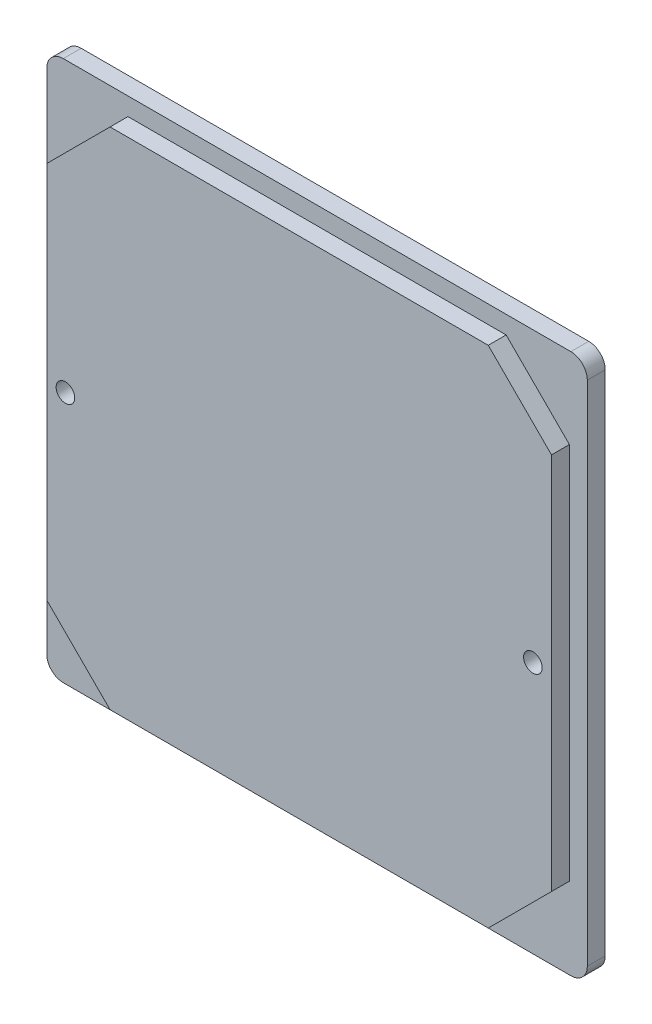
ISO-10303-21;
HEADER;
FILE_DESCRIPTION(('STEP AP214'),'2;1');
FILE_NAME('part.step','',(''),(''),'','','');
FILE_SCHEMA(('AUTOMOTIVE_DESIGN { 1 0 10303 214 1 1 1 1 }'));
ENDSEC;
DATA;
#1=APPLICATION_CONTEXT('core data for automotive mechanical design processes');
#2=APPLICATION_PROTOCOL_DEFINITION('international standard','automotive_design',2000,#1);
#3=PRODUCT_CONTEXT('',#1,'mechanical');
#4=PRODUCT('Part','Part','',(#3));
#5=PRODUCT_RELATED_PRODUCT_CATEGORY('part','',(#4));
#6=PRODUCT_DEFINITION_FORMATION('','',#4);
#7=PRODUCT_DEFINITION_CONTEXT('part definition',#1,'design');
#8=PRODUCT_DEFINITION('design','',#6,#7);
#9=PRODUCT_DEFINITION_SHAPE('','',#8);
#10=(LENGTH_UNIT() NAMED_UNIT(*) SI_UNIT(.MILLI.,.METRE.));
#11=(NAMED_UNIT(*) PLANE_ANGLE_UNIT() SI_UNIT($,.RADIAN.));
#12=(NAMED_UNIT(*) SI_UNIT($,.STERADIAN.) SOLID_ANGLE_UNIT());
#13=UNCERTAINTY_MEASURE_WITH_UNIT(LENGTH_MEASURE(1.E-05),#10,'distance_accuracy_value','');
#14=(GEOMETRIC_REPRESENTATION_CONTEXT(3) GLOBAL_UNCERTAINTY_ASSIGNED_CONTEXT((#13)) GLOBAL_UNIT_ASSIGNED_CONTEXT((#10,
#11,#12)) REPRESENTATION_CONTEXT('',''));
#15=CARTESIAN_POINT('',(0.,0.,0.));
#16=DIRECTION('',(0.,0.,1.));
#17=DIRECTION('',(1.,0.,0.));
#18=AXIS2_PLACEMENT_3D('',#15,#16,#17);
#19=CARTESIAN_POINT('',(0.,0.,5.));
#20=DIRECTION('',(0.,0.,-1.));
#21=DIRECTION('',(-1.,0.,0.));
#22=AXIS2_PLACEMENT_3D('',#19,#20,#21);
#23=PLANE('',#22);
#24=CARTESIAN_POINT('',(32.65,0.,5.));
#25=DIRECTION('',(0.,0.,1.));
#26=DIRECTION('',(1.,0.,0.));
#27=AXIS2_PLACEMENT_3D('',#24,#25,#26);
#28=CIRCLE('',#27,1.3);
#29=CARTESIAN_POINT('',(33.95,0.,5.));
#30=VERTEX_POINT('',#29);
#31=EDGE_CURVE('E238',#30,#30,#28,.T.);
#32=ORIENTED_EDGE('',*,*,#31,.F.);
#33=EDGE_LOOP('',(#32));
#34=FACE_BOUND('',#33,.T.);
#35=CARTESIAN_POINT('',(-32.65,0.,5.));
#36=DIRECTION('',(0.,0.,1.));
#37=DIRECTION('',(1.,0.,0.));
#38=AXIS2_PLACEMENT_3D('',#35,#36,#37);
#39=CIRCLE('',#38,1.3);
#40=CARTESIAN_POINT('',(-31.35,0.,5.));
#41=VERTEX_POINT('',#40);
#42=EDGE_CURVE('E244',#41,#41,#39,.T.);
#43=ORIENTED_EDGE('',*,*,#42,.F.);
#44=EDGE_LOOP('',(#43));
#45=FACE_BOUND('',#44,.T.);
#46=DIRECTION('',(-0.707106781186551,-0.707106781186544,0.));
#47=VECTOR('',#46,1.);
#48=CARTESIAN_POINT('',(-26.4111652351681,35.25,5.));
#49=LINE('',#48,#47);
#50=CARTESIAN_POINT('',(-26.4111652351681,35.25,5.));
#51=VERTEX_POINT('',#50);
#52=CARTESIAN_POINT('',(-35.25,26.4111652351682,5.));
#53=VERTEX_POINT('',#52);
#54=EDGE_CURVE('E195',#51,#53,#49,.T.);
#55=ORIENTED_EDGE('',*,*,#54,.T.);
#56=DIRECTION('',(0.,-1.,0.));
#57=VECTOR('',#56,1.);
#58=CARTESIAN_POINT('',(-35.25,26.4111652351682,5.));
#59=LINE('',#58,#57);
#60=CARTESIAN_POINT('',(-35.25,-26.4111652351682,5.));
#61=VERTEX_POINT('',#60);
#62=EDGE_CURVE('E155',#53,#61,#59,.T.);
#63=ORIENTED_EDGE('',*,*,#62,.T.);
#64=DIRECTION('',(0.70710678118655,-0.707106781186544,0.));
#65=VECTOR('',#64,1.);
#66=CARTESIAN_POINT('',(-26.4111652351681,-35.25,5.));
#67=LINE('',#66,#65);
#68=CARTESIAN_POINT('',(-26.4111652351681,-35.25,5.));
#69=VERTEX_POINT('',#68);
#70=EDGE_CURVE('E52',#61,#69,#67,.T.);
#71=ORIENTED_EDGE('',*,*,#70,.T.);
#72=DIRECTION('',(1.,0.,0.));
#73=VECTOR('',#72,1.);
#74=CARTESIAN_POINT('',(-26.4111652351681,-35.25,5.));
#75=LINE('',#74,#73);
#76=CARTESIAN_POINT('',(26.4111652351681,-35.25,5.));
#77=VERTEX_POINT('',#76);
#78=EDGE_CURVE('E199',#69,#77,#75,.T.);
#79=ORIENTED_EDGE('',*,*,#78,.T.);
#80=DIRECTION('',(0.70710678118655,0.707106781186544,0.));
#81=VECTOR('',#80,1.);
#82=CARTESIAN_POINT('',(26.4111652351681,-35.25,5.));
#83=LINE('',#82,#81);
#84=CARTESIAN_POINT('',(35.25,-26.4111652351682,5.));
#85=VERTEX_POINT('',#84);
#86=EDGE_CURVE('E202',#77,#85,#83,.T.);
#87=ORIENTED_EDGE('',*,*,#86,.T.);
#88=DIRECTION('',(0.,1.,0.));
#89=VECTOR('',#88,1.);
#90=CARTESIAN_POINT('',(35.25,26.4111652351682,5.));
#91=LINE('',#90,#89);
#92=CARTESIAN_POINT('',(35.25,26.4111652351682,5.));
#93=VERTEX_POINT('',#92);
#94=EDGE_CURVE('E205',#85,#93,#91,.T.);
#95=ORIENTED_EDGE('',*,*,#94,.T.);
#96=DIRECTION('',(-0.707106781186551,0.707106781186544,0.));
#97=VECTOR('',#96,1.);
#98=CARTESIAN_POINT('',(26.4111652351681,35.25,5.));
#99=LINE('',#98,#97);
#100=CARTESIAN_POINT('',(26.4111652351681,35.25,5.));
#101=VERTEX_POINT('',#100);
#102=EDGE_CURVE('E178',#93,#101,#99,.T.);
#103=ORIENTED_EDGE('',*,*,#102,.T.);
#104=DIRECTION('',(-1.,0.,0.));
#105=VECTOR('',#104,1.);
#106=CARTESIAN_POINT('',(-26.4111652351681,35.25,5.));
#107=LINE('',#106,#105);
#108=EDGE_CURVE('E175',#101,#51,#107,.T.);
#109=ORIENTED_EDGE('',*,*,#108,.T.);
#110=EDGE_LOOP('',(#55,#63,#71,#79,#87,#95,#103,#109));
#111=FACE_BOUND('',#110,.T.);
#112=ADVANCED_FACE('F37',(#34,#45,#111),#23,.F.);
#113=CARTESIAN_POINT('',(37.75,-37.75,5.));
#114=DIRECTION('',(-1.,0.,0.));
#115=DIRECTION('',(0.,0.,1.));
#116=AXIS2_PLACEMENT_3D('',#113,#114,#115);
#117=PLANE('',#116);
#118=DIRECTION('',(0.,1.,0.));
#119=VECTOR('',#118,1.);
#120=CARTESIAN_POINT('',(37.75,-35.45,2.5));
#121=LINE('',#120,#119);
#122=CARTESIAN_POINT('',(37.75,-35.45,2.5));
#123=VERTEX_POINT('',#122);
#124=CARTESIAN_POINT('',(37.75,35.45,2.5));
#125=VERTEX_POINT('',#124);
#126=EDGE_CURVE('E228',#123,#125,#121,.T.);
#127=ORIENTED_EDGE('',*,*,#126,.F.);
#128=DIRECTION('',(0.,0.,-1.));
#129=VECTOR('',#128,1.);
#130=CARTESIAN_POINT('',(37.75,-35.45,5.));
#131=LINE('',#130,#129);
#132=CARTESIAN_POINT('',(37.75,-35.45,0.));
#133=VERTEX_POINT('',#132);
#134=EDGE_CURVE('E264',#123,#133,#131,.T.);
#135=ORIENTED_EDGE('',*,*,#134,.T.);
#136=DIRECTION('',(0.,1.,0.));
#137=VECTOR('',#136,1.);
#138=CARTESIAN_POINT('',(37.75,-37.75,0.));
#139=LINE('',#138,#137);
#140=CARTESIAN_POINT('',(37.75,35.45,0.));
#141=VERTEX_POINT('',#140);
#142=EDGE_CURVE('E247',#133,#141,#139,.T.);
#143=ORIENTED_EDGE('',*,*,#142,.T.);
#144=DIRECTION('',(0.,0.,-1.));
#145=VECTOR('',#144,1.);
#146=CARTESIAN_POINT('',(37.75,35.45,5.));
#147=LINE('',#146,#145);
#148=EDGE_CURVE('E261',#141,#125,#147,.F.);
#149=ORIENTED_EDGE('',*,*,#148,.T.);
#150=EDGE_LOOP('',(#127,#135,#143,#149));
#151=FACE_BOUND('',#150,.T.);
#152=ADVANCED_FACE('F316',(#151),#117,.F.);
#153=CARTESIAN_POINT('',(-37.75,37.75,5.));
#154=DIRECTION('',(0.,-1.,0.));
#155=DIRECTION('',(0.,0.,-1.));
#156=AXIS2_PLACEMENT_3D('',#153,#154,#155);
#157=PLANE('',#156);
#158=DIRECTION('',(-1.,0.,0.));
#159=VECTOR('',#158,1.);
#160=CARTESIAN_POINT('',(35.45,37.75,2.5));
#161=LINE('',#160,#159);
#162=CARTESIAN_POINT('',(35.45,37.75,2.5));
#163=VERTEX_POINT('',#162);
#164=CARTESIAN_POINT('',(-35.45,37.75,2.5));
#165=VERTEX_POINT('',#164);
#166=EDGE_CURVE('E60',#163,#165,#161,.T.);
#167=ORIENTED_EDGE('',*,*,#166,.F.);
#168=DIRECTION('',(0.,0.,-1.));
#169=VECTOR('',#168,1.);
#170=CARTESIAN_POINT('',(35.45,37.75,5.));
#171=LINE('',#170,#169);
#172=CARTESIAN_POINT('',(35.45,37.75,0.));
#173=VERTEX_POINT('',#172);
#174=EDGE_CURVE('E11',#163,#173,#171,.T.);
#175=ORIENTED_EDGE('',*,*,#174,.T.);
#176=DIRECTION('',(-1.,0.,0.));
#177=VECTOR('',#176,1.);
#178=CARTESIAN_POINT('',(-37.75,37.75,0.));
#179=LINE('',#178,#177);
#180=CARTESIAN_POINT('',(-35.45,37.75,0.));
#181=VERTEX_POINT('',#180);
#182=EDGE_CURVE('E252',#173,#181,#179,.T.);
#183=ORIENTED_EDGE('',*,*,#182,.T.);
#184=DIRECTION('',(0.,0.,-1.));
#185=VECTOR('',#184,1.);
#186=CARTESIAN_POINT('',(-35.45,37.75,5.));
#187=LINE('',#186,#185);
#188=EDGE_CURVE('E45',#181,#165,#187,.F.);
#189=ORIENTED_EDGE('',*,*,#188,.T.);
#190=EDGE_LOOP('',(#167,#175,#183,#189));
#191=FACE_BOUND('',#190,.T.);
#192=ADVANCED_FACE('F286',(#191),#157,.F.);
#193=CARTESIAN_POINT('',(-37.75,-37.75,5.));
#194=DIRECTION('',(1.,0.,0.));
#195=DIRECTION('',(0.,0.,-1.));
#196=AXIS2_PLACEMENT_3D('',#193,#194,#195);
#197=PLANE('',#196);
#198=DIRECTION('',(0.,-1.,0.));
#199=VECTOR('',#198,1.);
#200=CARTESIAN_POINT('',(-37.75,35.45,2.5));
#201=LINE('',#200,#199);
#202=CARTESIAN_POINT('',(-37.75,35.45,2.5));
#203=VERTEX_POINT('',#202);
#204=CARTESIAN_POINT('',(-37.75,-35.45,2.5));
#205=VERTEX_POINT('',#204);
#206=EDGE_CURVE('E235',#203,#205,#201,.T.);
#207=ORIENTED_EDGE('',*,*,#206,.F.);
#208=DIRECTION('',(0.,0.,-1.));
#209=VECTOR('',#208,1.);
#210=CARTESIAN_POINT('',(-37.75,35.45,5.));
#211=LINE('',#210,#209);
#212=CARTESIAN_POINT('',(-37.75,35.45,0.));
#213=VERTEX_POINT('',#212);
#214=EDGE_CURVE('E279',#203,#213,#211,.T.);
#215=ORIENTED_EDGE('',*,*,#214,.T.);
#216=DIRECTION('',(0.,-1.,0.));
#217=VECTOR('',#216,1.);
#218=CARTESIAN_POINT('',(-37.75,-37.75,0.));
#219=LINE('',#218,#217);
#220=CARTESIAN_POINT('',(-37.75,-35.45,0.));
#221=VERTEX_POINT('',#220);
#222=EDGE_CURVE('E255',#213,#221,#219,.T.);
#223=ORIENTED_EDGE('',*,*,#222,.T.);
#224=DIRECTION('',(0.,0.,-1.));
#225=VECTOR('',#224,1.);
#226=CARTESIAN_POINT('',(-37.75,-35.45,5.));
#227=LINE('',#226,#225);
#228=EDGE_CURVE('E281',#221,#205,#227,.F.);
#229=ORIENTED_EDGE('',*,*,#228,.T.);
#230=EDGE_LOOP('',(#207,#215,#223,#229));
#231=FACE_BOUND('',#230,.T.);
#232=ADVANCED_FACE('F296',(#231),#197,.F.);
#233=CARTESIAN_POINT('',(-37.75,-37.75,5.));
#234=DIRECTION('',(0.,1.,0.));
#235=DIRECTION('',(0.,0.,1.));
#236=AXIS2_PLACEMENT_3D('',#233,#234,#235);
#237=PLANE('',#236);
#238=DIRECTION('',(1.,0.,0.));
#239=VECTOR('',#238,1.);
#240=CARTESIAN_POINT('',(-35.45,-37.75,2.5));
#241=LINE('',#240,#239);
#242=CARTESIAN_POINT('',(-35.45,-37.75,2.5));
#243=VERTEX_POINT('',#242);
#244=CARTESIAN_POINT('',(35.45,-37.75,2.5));
#245=VERTEX_POINT('',#244);
#246=EDGE_CURVE('E224',#243,#245,#241,.T.);
#247=ORIENTED_EDGE('',*,*,#246,.F.);
#248=DIRECTION('',(0.,0.,-1.));
#249=VECTOR('',#248,1.);
#250=CARTESIAN_POINT('',(-35.45,-37.75,5.));
#251=LINE('',#250,#249);
#252=CARTESIAN_POINT('',(-35.45,-37.75,0.));
#253=VERTEX_POINT('',#252);
#254=EDGE_CURVE('E274',#243,#253,#251,.T.);
#255=ORIENTED_EDGE('',*,*,#254,.T.);
#256=DIRECTION('',(1.,0.,0.));
#257=VECTOR('',#256,1.);
#258=CARTESIAN_POINT('',(-37.75,-37.75,0.));
#259=LINE('',#258,#257);
#260=CARTESIAN_POINT('',(35.45,-37.75,0.));
#261=VERTEX_POINT('',#260);
#262=EDGE_CURVE('E258',#253,#261,#259,.T.);
#263=ORIENTED_EDGE('',*,*,#262,.T.);
#264=DIRECTION('',(0.,0.,-1.));
#265=VECTOR('',#264,1.);
#266=CARTESIAN_POINT('',(35.45,-37.75,5.));
#267=LINE('',#266,#265);
#268=EDGE_CURVE('E276',#261,#245,#267,.F.);
#269=ORIENTED_EDGE('',*,*,#268,.T.);
#270=EDGE_LOOP('',(#247,#255,#263,#269));
#271=FACE_BOUND('',#270,.T.);
#272=ADVANCED_FACE('F306',(#271),#237,.F.);
#273=CARTESIAN_POINT('',(35.45,-35.45,5.));
#274=DIRECTION('',(0.,0.,-1.));
#275=DIRECTION('',(-1.,0.,0.));
#276=AXIS2_PLACEMENT_3D('',#273,#274,#275);
#277=CYLINDRICAL_SURFACE('',#276,2.3);
#278=ORIENTED_EDGE('',*,*,#134,.F.);
#279=CARTESIAN_POINT('',(35.45,-35.45,2.5));
#280=DIRECTION('',(0.,0.,1.));
#281=DIRECTION('',(1.,0.,0.));
#282=AXIS2_PLACEMENT_3D('',#279,#280,#281);
#283=CIRCLE('',#282,2.3);
#284=EDGE_CURVE('E226',#245,#123,#283,.T.);
#285=ORIENTED_EDGE('',*,*,#284,.F.);
#286=ORIENTED_EDGE('',*,*,#268,.F.);
#287=CARTESIAN_POINT('',(35.45,-35.45,0.));
#288=DIRECTION('',(0.,0.,-1.));
#289=DIRECTION('',(-1.,0.,0.));
#290=AXIS2_PLACEMENT_3D('',#287,#288,#289);
#291=CIRCLE('',#290,2.3);
#292=EDGE_CURVE('E272',#133,#261,#291,.T.);
#293=ORIENTED_EDGE('',*,*,#292,.F.);
#294=EDGE_LOOP('',(#278,#285,#286,#293));
#295=FACE_BOUND('',#294,.T.);
#296=ADVANCED_FACE('F311',(#295),#277,.T.);
#297=CARTESIAN_POINT('',(-35.45,-35.45,5.));
#298=DIRECTION('',(0.,0.,-1.));
#299=DIRECTION('',(-1.,0.,0.));
#300=AXIS2_PLACEMENT_3D('',#297,#298,#299);
#301=CYLINDRICAL_SURFACE('',#300,2.3);
#302=ORIENTED_EDGE('',*,*,#254,.F.);
#303=CARTESIAN_POINT('',(-35.45,-35.45,2.5));
#304=DIRECTION('',(0.,0.,1.));
#305=DIRECTION('',(1.,0.,0.));
#306=AXIS2_PLACEMENT_3D('',#303,#304,#305);
#307=CIRCLE('',#306,2.3);
#308=EDGE_CURVE('E211',#205,#243,#307,.T.);
#309=ORIENTED_EDGE('',*,*,#308,.F.);
#310=ORIENTED_EDGE('',*,*,#228,.F.);
#311=CARTESIAN_POINT('',(-35.45,-35.45,0.));
#312=DIRECTION('',(0.,0.,-1.));
#313=DIRECTION('',(-1.,0.,0.));
#314=AXIS2_PLACEMENT_3D('',#311,#312,#313);
#315=CIRCLE('',#314,2.3);
#316=EDGE_CURVE('E270',#253,#221,#315,.T.);
#317=ORIENTED_EDGE('',*,*,#316,.F.);
#318=EDGE_LOOP('',(#302,#309,#310,#317));
#319=FACE_BOUND('',#318,.T.);
#320=ADVANCED_FACE('F301',(#319),#301,.T.);
#321=CARTESIAN_POINT('',(35.45,35.45,5.));
#322=DIRECTION('',(0.,0.,-1.));
#323=DIRECTION('',(-1.,0.,0.));
#324=AXIS2_PLACEMENT_3D('',#321,#322,#323);
#325=CYLINDRICAL_SURFACE('',#324,2.3);
#326=ORIENTED_EDGE('',*,*,#174,.F.);
#327=CARTESIAN_POINT('',(35.45,35.45,2.5));
#328=DIRECTION('',(0.,0.,1.));
#329=DIRECTION('',(1.,0.,0.));
#330=AXIS2_PLACEMENT_3D('',#327,#328,#329);
#331=CIRCLE('',#330,2.30000000000001);
#332=EDGE_CURVE('E230',#125,#163,#331,.T.);
#333=ORIENTED_EDGE('',*,*,#332,.F.);
#334=ORIENTED_EDGE('',*,*,#148,.F.);
#335=CARTESIAN_POINT('',(35.45,35.45,0.));
#336=DIRECTION('',(0.,0.,-1.));
#337=DIRECTION('',(-1.,0.,0.));
#338=AXIS2_PLACEMENT_3D('',#335,#336,#337);
#339=CIRCLE('',#338,2.3);
#340=EDGE_CURVE('E268',#173,#141,#339,.T.);
#341=ORIENTED_EDGE('',*,*,#340,.F.);
#342=EDGE_LOOP('',(#326,#333,#334,#341));
#343=FACE_BOUND('',#342,.T.);
#344=ADVANCED_FACE('F320',(#343),#325,.T.);
#345=CARTESIAN_POINT('',(-35.45,35.45,5.));
#346=DIRECTION('',(0.,0.,-1.));
#347=DIRECTION('',(-1.,0.,0.));
#348=AXIS2_PLACEMENT_3D('',#345,#346,#347);
#349=CYLINDRICAL_SURFACE('',#348,2.3);
#350=ORIENTED_EDGE('',*,*,#214,.F.);
#351=CARTESIAN_POINT('',(-35.45,35.45,2.5));
#352=DIRECTION('',(0.,0.,1.));
#353=DIRECTION('',(1.,0.,0.));
#354=AXIS2_PLACEMENT_3D('',#351,#352,#353);
#355=CIRCLE('',#354,2.3);
#356=EDGE_CURVE('E233',#165,#203,#355,.T.);
#357=ORIENTED_EDGE('',*,*,#356,.F.);
#358=ORIENTED_EDGE('',*,*,#188,.F.);
#359=CARTESIAN_POINT('',(-35.45,35.45,0.));
#360=DIRECTION('',(0.,0.,-1.));
#361=DIRECTION('',(-1.,0.,0.));
#362=AXIS2_PLACEMENT_3D('',#359,#360,#361);
#363=CIRCLE('',#362,2.3);
#364=EDGE_CURVE('E266',#213,#181,#363,.T.);
#365=ORIENTED_EDGE('',*,*,#364,.F.);
#366=EDGE_LOOP('',(#350,#357,#358,#365));
#367=FACE_BOUND('',#366,.T.);
#368=ADVANCED_FACE('F39',(#367),#349,.T.);
#369=CARTESIAN_POINT('',(0.,0.,0.));
#370=DIRECTION('',(0.,0.,-1.));
#371=DIRECTION('',(-1.,0.,0.));
#372=AXIS2_PLACEMENT_3D('',#369,#370,#371);
#373=PLANE('',#372);
#374=CARTESIAN_POINT('',(-32.65,0.,0.));
#375=DIRECTION('',(0.,0.,1.));
#376=DIRECTION('',(1.,0.,0.));
#377=AXIS2_PLACEMENT_3D('',#374,#375,#376);
#378=CIRCLE('',#377,1.3);
#379=CARTESIAN_POINT('',(-31.35,0.,0.));
#380=VERTEX_POINT('',#379);
#381=EDGE_CURVE('E241',#380,#380,#378,.T.);
#382=ORIENTED_EDGE('',*,*,#381,.T.);
#383=EDGE_LOOP('',(#382));
#384=FACE_BOUND('',#383,.T.);
#385=ORIENTED_EDGE('',*,*,#142,.F.);
#386=ORIENTED_EDGE('',*,*,#292,.T.);
#387=ORIENTED_EDGE('',*,*,#262,.F.);
#388=ORIENTED_EDGE('',*,*,#316,.T.);
#389=ORIENTED_EDGE('',*,*,#222,.F.);
#390=ORIENTED_EDGE('',*,*,#364,.T.);
#391=ORIENTED_EDGE('',*,*,#182,.F.);
#392=ORIENTED_EDGE('',*,*,#340,.T.);
#393=EDGE_LOOP('',(#385,#386,#387,#388,#389,#390,#391,#392));
#394=FACE_BOUND('',#393,.T.);
#395=CARTESIAN_POINT('',(32.65,0.,0.));
#396=DIRECTION('',(0.,0.,1.));
#397=DIRECTION('',(1.,0.,0.));
#398=AXIS2_PLACEMENT_3D('',#395,#396,#397);
#399=CIRCLE('',#398,1.3);
#400=CARTESIAN_POINT('',(33.95,0.,0.));
#401=VERTEX_POINT('',#400);
#402=EDGE_CURVE('E237',#401,#401,#399,.T.);
#403=ORIENTED_EDGE('',*,*,#402,.T.);
#404=EDGE_LOOP('',(#403));
#405=FACE_BOUND('',#404,.T.);
#406=ADVANCED_FACE('F322',(#384,#394,#405),#373,.T.);
#407=CARTESIAN_POINT('',(-32.65,0.,5.));
#408=DIRECTION('',(0.,0.,-1.));
#409=DIRECTION('',(-1.,0.,0.));
#410=AXIS2_PLACEMENT_3D('',#407,#408,#409);
#411=CYLINDRICAL_SURFACE('',#410,1.3);
#412=ORIENTED_EDGE('',*,*,#42,.T.);
#413=EDGE_LOOP('',(#412));
#414=FACE_BOUND('',#413,.T.);
#415=ORIENTED_EDGE('',*,*,#381,.F.);
#416=EDGE_LOOP('',(#415));
#417=FACE_BOUND('',#416,.T.);
#418=ADVANCED_FACE('F325',(#414,#417),#411,.F.);
#419=CARTESIAN_POINT('',(32.65,0.,5.));
#420=DIRECTION('',(0.,0.,-1.));
#421=DIRECTION('',(-1.,0.,0.));
#422=AXIS2_PLACEMENT_3D('',#419,#420,#421);
#423=CYLINDRICAL_SURFACE('',#422,1.3);
#424=ORIENTED_EDGE('',*,*,#31,.T.);
#425=EDGE_LOOP('',(#424));
#426=FACE_BOUND('',#425,.T.);
#427=ORIENTED_EDGE('',*,*,#402,.F.);
#428=EDGE_LOOP('',(#427));
#429=FACE_BOUND('',#428,.T.);
#430=ADVANCED_FACE('F330',(#426,#429),#423,.F.);
#431=CARTESIAN_POINT('',(-35.45,-35.45,2.5));
#432=DIRECTION('',(0.,0.,1.));
#433=DIRECTION('',(1.,0.,0.));
#434=AXIS2_PLACEMENT_3D('',#431,#432,#433);
#435=PLANE('',#434);
#436=DIRECTION('',(-1.,0.,0.));
#437=VECTOR('',#436,1.);
#438=CARTESIAN_POINT('',(-26.4111652351681,35.25,2.5));
#439=LINE('',#438,#437);
#440=CARTESIAN_POINT('',(26.4111652351681,35.25,2.5));
#441=VERTEX_POINT('',#440);
#442=CARTESIAN_POINT('',(-26.4111652351681,35.25,2.5));
#443=VERTEX_POINT('',#442);
#444=EDGE_CURVE('E161',#441,#443,#439,.T.);
#445=ORIENTED_EDGE('',*,*,#444,.F.);
#446=DIRECTION('',(-0.707106781186551,0.707106781186544,0.));
#447=VECTOR('',#446,1.);
#448=CARTESIAN_POINT('',(26.4111652351681,35.25,2.5));
#449=LINE('',#448,#447);
#450=CARTESIAN_POINT('',(35.25,26.4111652351682,2.5));
#451=VERTEX_POINT('',#450);
#452=EDGE_CURVE('E191',#451,#441,#449,.T.);
#453=ORIENTED_EDGE('',*,*,#452,.F.);
#454=DIRECTION('',(0.,1.,0.));
#455=VECTOR('',#454,1.);
#456=CARTESIAN_POINT('',(35.25,26.4111652351682,2.5));
#457=LINE('',#456,#455);
#458=CARTESIAN_POINT('',(35.25,-26.4111652351682,2.5));
#459=VERTEX_POINT('',#458);
#460=EDGE_CURVE('E188',#459,#451,#457,.T.);
#461=ORIENTED_EDGE('',*,*,#460,.F.);
#462=DIRECTION('',(0.70710678118655,0.707106781186544,0.));
#463=VECTOR('',#462,1.);
#464=CARTESIAN_POINT('',(26.4111652351681,-35.25,2.5));
#465=LINE('',#464,#463);
#466=CARTESIAN_POINT('',(26.4111652351681,-35.25,2.5));
#467=VERTEX_POINT('',#466);
#468=EDGE_CURVE('E185',#467,#459,#465,.T.);
#469=ORIENTED_EDGE('',*,*,#468,.F.);
#470=DIRECTION('',(1.,0.,0.));
#471=VECTOR('',#470,1.);
#472=CARTESIAN_POINT('',(-26.4111652351681,-35.25,2.5));
#473=LINE('',#472,#471);
#474=CARTESIAN_POINT('',(-26.4111652351681,-35.25,2.5));
#475=VERTEX_POINT('',#474);
#476=EDGE_CURVE('E182',#475,#467,#473,.T.);
#477=ORIENTED_EDGE('',*,*,#476,.F.);
#478=DIRECTION('',(0.70710678118655,-0.707106781186544,0.));
#479=VECTOR('',#478,1.);
#480=CARTESIAN_POINT('',(-26.4111652351681,-35.25,2.5));
#481=LINE('',#480,#479);
#482=CARTESIAN_POINT('',(-35.25,-26.4111652351682,2.5));
#483=VERTEX_POINT('',#482);
#484=EDGE_CURVE('E171',#483,#475,#481,.T.);
#485=ORIENTED_EDGE('',*,*,#484,.F.);
#486=DIRECTION('',(0.,-1.,0.));
#487=VECTOR('',#486,1.);
#488=CARTESIAN_POINT('',(-35.25,26.4111652351682,2.5));
#489=LINE('',#488,#487);
#490=CARTESIAN_POINT('',(-35.25,26.4111652351682,2.5));
#491=VERTEX_POINT('',#490);
#492=EDGE_CURVE('E153',#491,#483,#489,.T.);
#493=ORIENTED_EDGE('',*,*,#492,.F.);
#494=DIRECTION('',(-0.707106781186551,-0.707106781186544,0.));
#495=VECTOR('',#494,1.);
#496=CARTESIAN_POINT('',(-26.4111652351681,35.25,2.5));
#497=LINE('',#496,#495);
#498=EDGE_CURVE('E167',#443,#491,#497,.T.);
#499=ORIENTED_EDGE('',*,*,#498,.F.);
#500=EDGE_LOOP('',(#445,#453,#461,#469,#477,#485,#493,#499));
#501=FACE_BOUND('',#500,.T.);
#502=ORIENTED_EDGE('',*,*,#308,.T.);
#503=ORIENTED_EDGE('',*,*,#246,.T.);
#504=ORIENTED_EDGE('',*,*,#284,.T.);
#505=ORIENTED_EDGE('',*,*,#126,.T.);
#506=ORIENTED_EDGE('',*,*,#332,.T.);
#507=ORIENTED_EDGE('',*,*,#166,.T.);
#508=ORIENTED_EDGE('',*,*,#356,.T.);
#509=ORIENTED_EDGE('',*,*,#206,.T.);
#510=EDGE_LOOP('',(#502,#503,#504,#505,#506,#507,#508,#509));
#511=FACE_BOUND('',#510,.T.);
#512=ADVANCED_FACE('F166',(#501,#511),#435,.T.);
#513=CARTESIAN_POINT('',(-26.4111652351681,35.25,2.5));
#514=DIRECTION('',(-0.707106781186544,0.707106781186551,0.));
#515=DIRECTION('',(-0.707106781186551,-0.707106781186544,0.));
#516=AXIS2_PLACEMENT_3D('',#513,#514,#515);
#517=PLANE('',#516);
#518=ORIENTED_EDGE('',*,*,#54,.F.);
#519=DIRECTION('',(0.,0.,1.));
#520=VECTOR('',#519,1.);
#521=CARTESIAN_POINT('',(-26.4111652351681,35.25,2.5));
#522=LINE('',#521,#520);
#523=EDGE_CURVE('E174',#443,#51,#522,.T.);
#524=ORIENTED_EDGE('',*,*,#523,.F.);
#525=ORIENTED_EDGE('',*,*,#498,.T.);
#526=DIRECTION('',(0.,0.,1.));
#527=VECTOR('',#526,1.);
#528=CARTESIAN_POINT('',(-35.25,26.4111652351682,2.5));
#529=LINE('',#528,#527);
#530=EDGE_CURVE('E150',#491,#53,#529,.T.);
#531=ORIENTED_EDGE('',*,*,#530,.T.);
#532=EDGE_LOOP('',(#518,#524,#525,#531));
#533=FACE_BOUND('',#532,.T.);
#534=ADVANCED_FACE('F173',(#533),#517,.T.);
#535=CARTESIAN_POINT('',(-26.4111652351681,35.25,2.5));
#536=DIRECTION('',(0.,1.,0.));
#537=DIRECTION('',(-1.,0.,0.));
#538=AXIS2_PLACEMENT_3D('',#535,#536,#537);
#539=PLANE('',#538);
#540=ORIENTED_EDGE('',*,*,#108,.F.);
#541=DIRECTION('',(0.,0.,1.));
#542=VECTOR('',#541,1.);
#543=CARTESIAN_POINT('',(26.4111652351681,35.25,2.5));
#544=LINE('',#543,#542);
#545=EDGE_CURVE('E212',#441,#101,#544,.T.);
#546=ORIENTED_EDGE('',*,*,#545,.F.);
#547=ORIENTED_EDGE('',*,*,#444,.T.);
#548=ORIENTED_EDGE('',*,*,#523,.T.);
#549=EDGE_LOOP('',(#540,#546,#547,#548));
#550=FACE_BOUND('',#549,.T.);
#551=ADVANCED_FACE('F433',(#550),#539,.T.);
#552=CARTESIAN_POINT('',(26.4111652351681,35.25,2.5));
#553=DIRECTION('',(0.707106781186544,0.707106781186551,0.));
#554=DIRECTION('',(-0.707106781186551,0.707106781186544,0.));
#555=AXIS2_PLACEMENT_3D('',#552,#553,#554);
#556=PLANE('',#555);
#557=ORIENTED_EDGE('',*,*,#102,.F.);
#558=DIRECTION('',(0.,0.,1.));
#559=VECTOR('',#558,1.);
#560=CARTESIAN_POINT('',(35.25,26.4111652351682,2.5));
#561=LINE('',#560,#559);
#562=EDGE_CURVE('E214',#451,#93,#561,.T.);
#563=ORIENTED_EDGE('',*,*,#562,.F.);
#564=ORIENTED_EDGE('',*,*,#452,.T.);
#565=ORIENTED_EDGE('',*,*,#545,.T.);
#566=EDGE_LOOP('',(#557,#563,#564,#565));
#567=FACE_BOUND('',#566,.T.);
#568=ADVANCED_FACE('F441',(#567),#556,.T.);
#569=CARTESIAN_POINT('',(35.25,26.4111652351682,2.5));
#570=DIRECTION('',(1.,0.,0.));
#571=DIRECTION('',(0.,1.,0.));
#572=AXIS2_PLACEMENT_3D('',#569,#570,#571);
#573=PLANE('',#572);
#574=ORIENTED_EDGE('',*,*,#94,.F.);
#575=DIRECTION('',(0.,0.,1.));
#576=VECTOR('',#575,1.);
#577=CARTESIAN_POINT('',(35.25,-26.4111652351682,2.5));
#578=LINE('',#577,#576);
#579=EDGE_CURVE('E216',#459,#85,#578,.T.);
#580=ORIENTED_EDGE('',*,*,#579,.F.);
#581=ORIENTED_EDGE('',*,*,#460,.T.);
#582=ORIENTED_EDGE('',*,*,#562,.T.);
#583=EDGE_LOOP('',(#574,#580,#581,#582));
#584=FACE_BOUND('',#583,.T.);
#585=ADVANCED_FACE('F450',(#584),#573,.T.);
#586=CARTESIAN_POINT('',(26.4111652351681,-35.25,2.5));
#587=DIRECTION('',(0.707106781186544,-0.707106781186551,0.));
#588=DIRECTION('',(0.707106781186551,0.707106781186544,0.));
#589=AXIS2_PLACEMENT_3D('',#586,#587,#588);
#590=PLANE('',#589);
#591=ORIENTED_EDGE('',*,*,#86,.F.);
#592=DIRECTION('',(0.,0.,1.));
#593=VECTOR('',#592,1.);
#594=CARTESIAN_POINT('',(26.4111652351681,-35.25,2.5));
#595=LINE('',#594,#593);
#596=EDGE_CURVE('E218',#467,#77,#595,.T.);
#597=ORIENTED_EDGE('',*,*,#596,.F.);
#598=ORIENTED_EDGE('',*,*,#468,.T.);
#599=ORIENTED_EDGE('',*,*,#579,.T.);
#600=EDGE_LOOP('',(#591,#597,#598,#599));
#601=FACE_BOUND('',#600,.T.);
#602=ADVANCED_FACE('F459',(#601),#590,.T.);
#603=CARTESIAN_POINT('',(-26.4111652351681,-35.25,2.5));
#604=DIRECTION('',(0.,-1.,0.));
#605=DIRECTION('',(0.,0.,-1.));
#606=AXIS2_PLACEMENT_3D('',#603,#604,#605);
#607=PLANE('',#606);
#608=ORIENTED_EDGE('',*,*,#78,.F.);
#609=DIRECTION('',(0.,0.,1.));
#610=VECTOR('',#609,1.);
#611=CARTESIAN_POINT('',(-26.4111652351681,-35.25,2.5));
#612=LINE('',#611,#610);
#613=EDGE_CURVE('E220',#475,#69,#612,.T.);
#614=ORIENTED_EDGE('',*,*,#613,.F.);
#615=ORIENTED_EDGE('',*,*,#476,.T.);
#616=ORIENTED_EDGE('',*,*,#596,.T.);
#617=EDGE_LOOP('',(#608,#614,#615,#616));
#618=FACE_BOUND('',#617,.T.);
#619=ADVANCED_FACE('F468',(#618),#607,.T.);
#620=CARTESIAN_POINT('',(-26.4111652351681,-35.25,2.5));
#621=DIRECTION('',(-0.707106781186544,-0.707106781186551,0.));
#622=DIRECTION('',(0.707106781186551,-0.707106781186544,0.));
#623=AXIS2_PLACEMENT_3D('',#620,#621,#622);
#624=PLANE('',#623);
#625=ORIENTED_EDGE('',*,*,#70,.F.);
#626=DIRECTION('',(0.,0.,1.));
#627=VECTOR('',#626,1.);
#628=CARTESIAN_POINT('',(-35.25,-26.4111652351682,2.5));
#629=LINE('',#628,#627);
#630=EDGE_CURVE('E160',#483,#61,#629,.T.);
#631=ORIENTED_EDGE('',*,*,#630,.F.);
#632=ORIENTED_EDGE('',*,*,#484,.T.);
#633=ORIENTED_EDGE('',*,*,#613,.T.);
#634=EDGE_LOOP('',(#625,#631,#632,#633));
#635=FACE_BOUND('',#634,.T.);
#636=ADVANCED_FACE('F477',(#635),#624,.T.);
#637=CARTESIAN_POINT('',(-35.25,26.4111652351682,2.5));
#638=DIRECTION('',(-1.,0.,0.));
#639=DIRECTION('',(0.,-1.,0.));
#640=AXIS2_PLACEMENT_3D('',#637,#638,#639);
#641=PLANE('',#640);
#642=ORIENTED_EDGE('',*,*,#62,.F.);
#643=ORIENTED_EDGE('',*,*,#530,.F.);
#644=ORIENTED_EDGE('',*,*,#492,.T.);
#645=ORIENTED_EDGE('',*,*,#630,.T.);
#646=EDGE_LOOP('',(#642,#643,#644,#645));
#647=FACE_BOUND('',#646,.T.);
#648=ADVANCED_FACE('F152',(#647),#641,.T.);
#649=CLOSED_SHELL('',(#112,#152,#192,#232,#272,#296,#320,#344,#368,#406,#418,#430,#512,#534,
#551,#568,#585,#602,#619,#636,#648));
#650=MANIFOLD_SOLID_BREP('B2',#649);
#651=ADVANCED_BREP_SHAPE_REPRESENTATION('',(#18,#650),#14);
#652=SHAPE_DEFINITION_REPRESENTATION(#9,#651);
ENDSEC;
END-ISO-10303-21;
